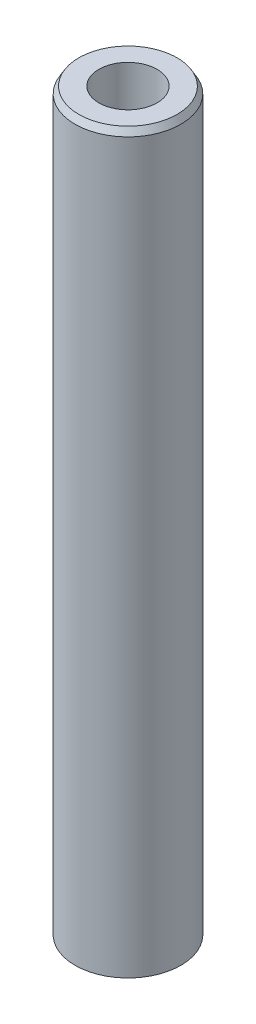
ISO-10303-21;
HEADER;
FILE_DESCRIPTION(('STEP AP214'),'2;1');
FILE_NAME('part.step','',(''),(''),'','','');
FILE_SCHEMA(('AUTOMOTIVE_DESIGN { 1 0 10303 214 1 1 1 1 }'));
ENDSEC;
DATA;
#1=APPLICATION_CONTEXT('core data for automotive mechanical design processes');
#2=APPLICATION_PROTOCOL_DEFINITION('international standard','automotive_design',2000,#1);
#3=PRODUCT_CONTEXT('',#1,'mechanical');
#4=PRODUCT('Part','Part','',(#3));
#5=PRODUCT_RELATED_PRODUCT_CATEGORY('part','',(#4));
#6=PRODUCT_DEFINITION_FORMATION('','',#4);
#7=PRODUCT_DEFINITION_CONTEXT('part definition',#1,'design');
#8=PRODUCT_DEFINITION('design','',#6,#7);
#9=PRODUCT_DEFINITION_SHAPE('','',#8);
#10=(LENGTH_UNIT() NAMED_UNIT(*) SI_UNIT(.MILLI.,.METRE.));
#11=(NAMED_UNIT(*) PLANE_ANGLE_UNIT() SI_UNIT($,.RADIAN.));
#12=(NAMED_UNIT(*) SI_UNIT($,.STERADIAN.) SOLID_ANGLE_UNIT());
#13=UNCERTAINTY_MEASURE_WITH_UNIT(LENGTH_MEASURE(1.E-05),#10,'distance_accuracy_value','');
#14=(GEOMETRIC_REPRESENTATION_CONTEXT(3) GLOBAL_UNCERTAINTY_ASSIGNED_CONTEXT((#13)) GLOBAL_UNIT_ASSIGNED_CONTEXT((#10,
#11,#12)) REPRESENTATION_CONTEXT('',''));
#15=CARTESIAN_POINT('',(0.,0.,0.));
#16=DIRECTION('',(0.,0.,1.));
#17=DIRECTION('',(1.,0.,0.));
#18=AXIS2_PLACEMENT_3D('',#15,#16,#17);
#19=CARTESIAN_POINT('',(0.,279.242839232548,0.));
#20=DIRECTION('',(0.,-1.,0.));
#21=DIRECTION('',(0.,0.,-1.));
#22=AXIS2_PLACEMENT_3D('',#19,#20,#21);
#23=CYLINDRICAL_SURFACE('',#22,20.);
#24=CARTESIAN_POINT('',(0.,276.74977096159,0.));
#25=DIRECTION('',(0.,1.,0.));
#26=DIRECTION('',(0.,0.,1.));
#27=AXIS2_PLACEMENT_3D('',#24,#25,#26);
#28=CIRCLE('',#27,20.);
#29=CARTESIAN_POINT('',(0.,276.74977096159,20.));
#30=VERTEX_POINT('',#29);
#31=EDGE_CURVE('E50',#30,#30,#28,.F.);
#32=ORIENTED_EDGE('',*,*,#31,.T.);
#33=EDGE_LOOP('',(#32));
#34=FACE_BOUND('',#33,.T.);
#35=CARTESIAN_POINT('',(0.,1.4393736373457,0.));
#36=DIRECTION('',(0.,1.,0.));
#37=DIRECTION('',(0.,0.,1.));
#38=AXIS2_PLACEMENT_3D('',#35,#36,#37);
#39=CIRCLE('',#38,20.);
#40=CARTESIAN_POINT('',(0.,1.4393736373457,20.));
#41=VERTEX_POINT('',#40);
#42=EDGE_CURVE('E51',#41,#41,#39,.T.);
#43=ORIENTED_EDGE('',*,*,#42,.T.);
#44=EDGE_LOOP('',(#43));
#45=FACE_BOUND('',#44,.T.);
#46=ADVANCED_FACE('F39',(#34,#45),#23,.T.);
#47=CARTESIAN_POINT('',(0.,279.242839232548,0.));
#48=DIRECTION('',(0.,1.,0.));
#49=DIRECTION('',(0.,0.,1.));
#50=AXIS2_PLACEMENT_3D('',#47,#48,#49);
#51=PLANE('',#50);
#52=CARTESIAN_POINT('',(0.,279.242839232548,0.));
#53=DIRECTION('',(0.,1.,0.));
#54=DIRECTION('',(0.,0.,1.));
#55=AXIS2_PLACEMENT_3D('',#52,#53,#54);
#56=CIRCLE('',#55,18.5606263626543);
#57=CARTESIAN_POINT('',(0.,279.242839232548,18.5606263626543));
#58=VERTEX_POINT('',#57);
#59=EDGE_CURVE('E54',#58,#58,#56,.T.);
#60=ORIENTED_EDGE('',*,*,#59,.T.);
#61=EDGE_LOOP('',(#60));
#62=FACE_BOUND('',#61,.T.);
#63=CARTESIAN_POINT('',(0.,279.242839232548,0.));
#64=DIRECTION('',(0.,1.,0.));
#65=DIRECTION('',(0.,0.,1.));
#66=AXIS2_PLACEMENT_3D('',#63,#64,#65);
#67=CIRCLE('',#66,10.9991454385759);
#68=CARTESIAN_POINT('',(0.,279.242839232548,10.9991454385759));
#69=VERTEX_POINT('',#68);
#70=EDGE_CURVE('E58',#69,#69,#67,.T.);
#71=ORIENTED_EDGE('',*,*,#70,.F.);
#72=EDGE_LOOP('',(#71));
#73=FACE_BOUND('',#72,.T.);
#74=ADVANCED_FACE('F69',(#62,#73),#51,.T.);
#75=CARTESIAN_POINT('',(0.,0.,0.));
#76=DIRECTION('',(0.,1.,0.));
#77=DIRECTION('',(0.,0.,1.));
#78=AXIS2_PLACEMENT_3D('',#75,#76,#77);
#79=PLANE('',#78);
#80=CARTESIAN_POINT('',(0.,0.,0.));
#81=DIRECTION('',(0.,1.,0.));
#82=DIRECTION('',(0.,0.,1.));
#83=AXIS2_PLACEMENT_3D('',#80,#81,#82);
#84=CIRCLE('',#83,17.506931729042);
#85=CARTESIAN_POINT('',(0.,0.,17.506931729042));
#86=VERTEX_POINT('',#85);
#87=EDGE_CURVE('E10',#86,#86,#84,.F.);
#88=ORIENTED_EDGE('',*,*,#87,.T.);
#89=EDGE_LOOP('',(#88));
#90=FACE_BOUND('',#89,.T.);
#91=CARTESIAN_POINT('',(0.,0.,0.));
#92=DIRECTION('',(0.,1.,0.));
#93=DIRECTION('',(0.,0.,1.));
#94=AXIS2_PLACEMENT_3D('',#91,#92,#93);
#95=CIRCLE('',#94,10.9991454385759);
#96=CARTESIAN_POINT('',(0.,0.,10.9991454385759));
#97=VERTEX_POINT('',#96);
#98=EDGE_CURVE('E63',#97,#97,#95,.T.);
#99=ORIENTED_EDGE('',*,*,#98,.T.);
#100=EDGE_LOOP('',(#99));
#101=FACE_BOUND('',#100,.T.);
#102=ADVANCED_FACE('F75',(#90,#101),#79,.F.);
#103=CARTESIAN_POINT('',(0.,279.242839232548,0.));
#104=DIRECTION('',(0.,-1.,0.));
#105=DIRECTION('',(0.,0.,-1.));
#106=AXIS2_PLACEMENT_3D('',#103,#104,#105);
#107=CYLINDRICAL_SURFACE('',#106,10.9991454385759);
#108=ORIENTED_EDGE('',*,*,#70,.T.);
#109=EDGE_LOOP('',(#108));
#110=FACE_BOUND('',#109,.T.);
#111=ORIENTED_EDGE('',*,*,#98,.F.);
#112=EDGE_LOOP('',(#111));
#113=FACE_BOUND('',#112,.T.);
#114=ADVANCED_FACE('F70',(#110,#113),#107,.F.);
#115=CARTESIAN_POINT('',(0.,279.242839232548,0.));
#116=DIRECTION('',(0.,-1.,0.));
#117=DIRECTION('',(0.,0.,-1.));
#118=AXIS2_PLACEMENT_3D('',#115,#116,#117);
#119=CONICAL_SURFACE('',#118,18.5606263626543,0.523598775598291);
#120=ORIENTED_EDGE('',*,*,#31,.F.);
#121=EDGE_LOOP('',(#120));
#122=FACE_BOUND('',#121,.T.);
#123=ORIENTED_EDGE('',*,*,#59,.F.);
#124=EDGE_LOOP('',(#123));
#125=FACE_BOUND('',#124,.T.);
#126=ADVANCED_FACE('F81',(#122,#125),#119,.T.);
#127=CARTESIAN_POINT('',(0.,1.4393736373457,0.));
#128=DIRECTION('',(0.,1.,0.));
#129=DIRECTION('',(0.,0.,1.));
#130=AXIS2_PLACEMENT_3D('',#127,#128,#129);
#131=CONICAL_SURFACE('',#130,20.,1.04719755119661);
#132=CARTESIAN_POINT('',(0.,0.,17.506931729042));
#133=CARTESIAN_POINT('',(0.,0.0149934753890178,17.5329011901978));
#134=CARTESIAN_POINT('',(0.,0.0299869507780355,17.5588706513536));
#135=CARTESIAN_POINT('',(0.,0.0599739015560707,17.6108095736652));
#136=CARTESIAN_POINT('',(0.,0.0749673769450883,17.636779034821));
#137=CARTESIAN_POINT('',(0.,0.104954327723123,17.6887179571327));
#138=CARTESIAN_POINT('',(0.,0.119947803112141,17.7146874182885));
#139=CARTESIAN_POINT('',(0.,0.149934753890176,17.7666263406001));
#140=CARTESIAN_POINT('',(0.,0.164928229279195,17.7925958017559));
#141=CARTESIAN_POINT('',(0.,0.19491518005723,17.8445347240675));
#142=CARTESIAN_POINT('',(0.,0.209908655446247,17.8705041852233));
#143=CARTESIAN_POINT('',(0.,0.239895606224282,17.922443107535));
#144=CARTESIAN_POINT('',(0.,0.254889081613301,17.9484125686908));
#145=CARTESIAN_POINT('',(0.,0.284876032391336,18.0003514910024));
#146=CARTESIAN_POINT('',(0.,0.299869507780354,18.0263209521582));
#147=CARTESIAN_POINT('',(0.,0.329856458558389,18.0782598744699));
#148=CARTESIAN_POINT('',(0.,0.344849933947406,18.1042293356257));
#149=CARTESIAN_POINT('',(0.,0.374836884725442,18.1561682579373));
#150=CARTESIAN_POINT('',(0.,0.38983036011446,18.1821377190931));
#151=CARTESIAN_POINT('',(0.,0.419817310892495,18.2340766414047));
#152=CARTESIAN_POINT('',(0.,0.434810786281512,18.2600461025605));
#153=CARTESIAN_POINT('',(0.,0.464797737059548,18.3119850248722));
#154=CARTESIAN_POINT('',(0.,0.479791212448566,18.337954486028));
#155=CARTESIAN_POINT('',(0.,0.509778163226601,18.3898934083396));
#156=CARTESIAN_POINT('',(0.,0.524771638615619,18.4158628694954));
#157=CARTESIAN_POINT('',(0.,0.554758589393654,18.467801791807));
#158=CARTESIAN_POINT('',(0.,0.569752064782671,18.4937712529629));
#159=CARTESIAN_POINT('',(0.,0.599739015560707,18.5457101752745));
#160=CARTESIAN_POINT('',(0.,0.614732490949725,18.5716796364303));
#161=CARTESIAN_POINT('',(0.,0.64471944172776,18.6236185587419));
#162=CARTESIAN_POINT('',(0.,0.659712917116778,18.6495880198977));
#163=CARTESIAN_POINT('',(0.,0.689699867894813,18.7015269422094));
#164=CARTESIAN_POINT('',(0.,0.704693343283831,18.7274964033652));
#165=CARTESIAN_POINT('',(0.,0.734680294061867,18.7794353256768));
#166=CARTESIAN_POINT('',(0.,0.749673769450884,18.8054047868326));
#167=CARTESIAN_POINT('',(0.,0.779660720228919,18.8573437091442));
#168=CARTESIAN_POINT('',(0.,0.794654195617937,18.8833131703));
#169=CARTESIAN_POINT('',(0.,0.824641146395972,18.9352520926117));
#170=CARTESIAN_POINT('',(0.,0.83963462178499,18.9612215537675));
#171=CARTESIAN_POINT('',(0.,0.869621572563026,19.0131604760791));
#172=CARTESIAN_POINT('',(0.,0.884615047952043,19.0391299372349));
#173=CARTESIAN_POINT('',(0.,0.914601998730078,19.0910688595466));
#174=CARTESIAN_POINT('',(0.,0.929595474119096,19.1170383207024));
#175=CARTESIAN_POINT('',(0.,0.959582424897132,19.168977243014));
#176=CARTESIAN_POINT('',(0.,0.97457590028615,19.1949467041698));
#177=CARTESIAN_POINT('',(0.,1.00456285106418,19.2468856264814));
#178=CARTESIAN_POINT('',(0.,1.0195563264532,19.2728550876372));
#179=CARTESIAN_POINT('',(0.,1.04954327723124,19.3247940099489));
#180=CARTESIAN_POINT('',(0.,1.06453675262026,19.3507634711047));
#181=CARTESIAN_POINT('',(0.,1.09452370339829,19.4027023934163));
#182=CARTESIAN_POINT('',(0.,1.10951717878731,19.4286718545721));
#183=CARTESIAN_POINT('',(0.,1.13950412956534,19.4806107768837));
#184=CARTESIAN_POINT('',(0.,1.15449760495436,19.5065802380396));
#185=CARTESIAN_POINT('',(0.,1.1844845557324,19.5585191603512));
#186=CARTESIAN_POINT('',(0.,1.19947803112141,19.584488621507));
#187=CARTESIAN_POINT('',(0.,1.22946498189945,19.6364275438186));
#188=CARTESIAN_POINT('',(0.,1.24445845728847,19.6623970049744));
#189=CARTESIAN_POINT('',(0.,1.2744454080665,19.7143359272861));
#190=CARTESIAN_POINT('',(0.,1.28943888345552,19.7403053884419));
#191=CARTESIAN_POINT('',(0.,1.31942583423356,19.7922443107535));
#192=CARTESIAN_POINT('',(0.,1.33441930962257,19.8182137719093));
#193=CARTESIAN_POINT('',(0.,1.36440626040061,19.8701526942209));
#194=CARTESIAN_POINT('',(0.,1.37939973578963,19.8961221553767));
#195=CARTESIAN_POINT('',(0.,1.40938668656766,19.9480610776884));
#196=CARTESIAN_POINT('',(0.,1.42438016195668,19.9740305388442));
#197=CARTESIAN_POINT('',(0.,1.4393736373457,20.));
#198=B_SPLINE_CURVE_WITH_KNOTS('',3,(#132,#133,#134,#135,#136,#137,#138,#139,#140,#141,#142,
#143,#144,#145,#146,#147,#148,#149,#150,#151,#152,#153,#154,#155,#156,#157,#158,#159,#160,#161,
#162,#163,#164,#165,#166,#167,#168,#169,#170,#171,#172,#173,#174,#175,#176,#177,#178,#179,#180,
#181,#182,#183,#184,#185,#186,#187,#188,#189,#190,#191,#192,#193,#194,#195,#196,#197),
.UNSPECIFIED.,.F.,.F.,(4,2,2,2,2,2,2,2,2,2,2,2,2,2,2,2,2,2,2,2,2,2,2,2,2,2,2,2,2,2,2,2,4),(0.,
0.089960852334106,0.179921704668215,0.269882557002324,0.35984340933643,0.449804261670539,
0.539765114004645,0.629725966338754,0.719686818672863,0.809647671006969,0.899608523341078,
0.989569375675184,1.07953022800929,1.1694910803434,1.25945193267751,1.34941278501162,
1.43937363734572,1.52933448967983,1.61929534201394,1.70925619434805,1.79921704668216,
1.88917789901626,1.97913875135037,2.06909960368448,2.15906045601859,2.2490213083527,
2.3389821606868,2.42894301302091,2.51890386535502,2.60886471768913,2.69882557002324,
2.78878642235734,2.87874727469145),.UNSPECIFIED.);
#199=EDGE_CURVE('BSEAM45',#86,#41,#198,.T.);
#200=ORIENTED_EDGE('',*,*,#87,.F.);
#201=ORIENTED_EDGE('',*,*,#42,.F.);
#202=ORIENTED_EDGE('',*,*,#199,.T.);
#203=ORIENTED_EDGE('',*,*,#199,.F.);
#204=EDGE_LOOP('',(#200,#202,#201,#203));
#205=FACE_BOUND('',#204,.T.);
#206=ADVANCED_FACE('F45',(#205),#131,.T.);
#207=CLOSED_SHELL('',(#46,#74,#102,#114,#126,#206));
#208=MANIFOLD_SOLID_BREP('B2',#207);
#209=ADVANCED_BREP_SHAPE_REPRESENTATION('',(#18,#208),#14);
#210=SHAPE_DEFINITION_REPRESENTATION(#9,#209);
ENDSEC;
END-ISO-10303-21;
